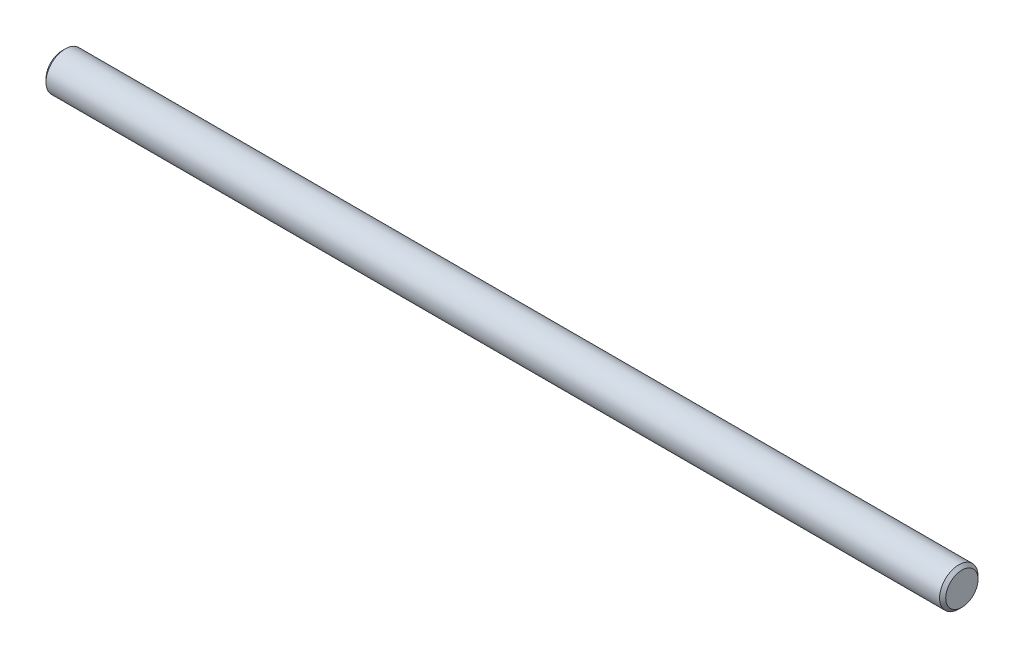
ISO-10303-21;
HEADER;
FILE_DESCRIPTION(('STEP AP214'),'2;1');
FILE_NAME('part.step','',(''),(''),'','','');
FILE_SCHEMA(('AUTOMOTIVE_DESIGN { 1 0 10303 214 1 1 1 1 }'));
ENDSEC;
DATA;
#1=APPLICATION_CONTEXT('core data for automotive mechanical design processes');
#2=APPLICATION_PROTOCOL_DEFINITION('international standard','automotive_design',2000,#1);
#3=PRODUCT_CONTEXT('',#1,'mechanical');
#4=PRODUCT('Part','Part','',(#3));
#5=PRODUCT_RELATED_PRODUCT_CATEGORY('part','',(#4));
#6=PRODUCT_DEFINITION_FORMATION('','',#4);
#7=PRODUCT_DEFINITION_CONTEXT('part definition',#1,'design');
#8=PRODUCT_DEFINITION('design','',#6,#7);
#9=PRODUCT_DEFINITION_SHAPE('','',#8);
#10=(LENGTH_UNIT() NAMED_UNIT(*) SI_UNIT(.MILLI.,.METRE.));
#11=(NAMED_UNIT(*) PLANE_ANGLE_UNIT() SI_UNIT($,.RADIAN.));
#12=(NAMED_UNIT(*) SI_UNIT($,.STERADIAN.) SOLID_ANGLE_UNIT());
#13=UNCERTAINTY_MEASURE_WITH_UNIT(LENGTH_MEASURE(1.E-05),#10,'distance_accuracy_value','');
#14=(GEOMETRIC_REPRESENTATION_CONTEXT(3) GLOBAL_UNCERTAINTY_ASSIGNED_CONTEXT((#13)) GLOBAL_UNIT_ASSIGNED_CONTEXT((#10,
#11,#12)) REPRESENTATION_CONTEXT('',''));
#15=CARTESIAN_POINT('',(0.,0.,0.));
#16=DIRECTION('',(0.,0.,1.));
#17=DIRECTION('',(1.,0.,0.));
#18=AXIS2_PLACEMENT_3D('',#15,#16,#17);
#19=CARTESIAN_POINT('',(0.,0.,0.));
#20=DIRECTION('',(1.,0.,0.));
#21=DIRECTION('',(0.,0.,-1.));
#22=AXIS2_PLACEMENT_3D('',#19,#20,#21);
#23=PLANE('',#22);
#24=CARTESIAN_POINT('',(0.,0.,0.));
#25=DIRECTION('',(1.,0.,0.));
#26=DIRECTION('',(0.,0.,-1.));
#27=AXIS2_PLACEMENT_3D('',#24,#25,#26);
#28=CIRCLE('',#27,2.10000000000002);
#29=CARTESIAN_POINT('',(0.,0.,-2.10000000000002));
#30=VERTEX_POINT('',#29);
#31=EDGE_CURVE('E10',#30,#30,#28,.F.);
#32=ORIENTED_EDGE('',*,*,#31,.T.);
#33=EDGE_LOOP('',(#32));
#34=FACE_BOUND('',#33,.T.);
#35=ADVANCED_FACE('F38',(#34),#23,.F.);
#36=CARTESIAN_POINT('',(0.,0.,0.));
#37=DIRECTION('',(-1.,0.,0.));
#38=DIRECTION('',(0.,0.,1.));
#39=AXIS2_PLACEMENT_3D('',#36,#37,#38);
#40=CYLINDRICAL_SURFACE('',#39,2.5);
#41=CARTESIAN_POINT('',(116.6,0.,0.));
#42=DIRECTION('',(-1.,0.,0.));
#43=DIRECTION('',(0.,0.,1.));
#44=AXIS2_PLACEMENT_3D('',#41,#42,#43);
#45=CIRCLE('',#44,2.5);
#46=CARTESIAN_POINT('',(116.6,0.,2.5));
#47=VERTEX_POINT('',#46);
#48=EDGE_CURVE('E51',#47,#47,#45,.T.);
#49=ORIENTED_EDGE('',*,*,#48,.T.);
#50=EDGE_LOOP('',(#49));
#51=FACE_BOUND('',#50,.T.);
#52=CARTESIAN_POINT('',(0.399999999999989,0.,0.));
#53=DIRECTION('',(1.,0.,0.));
#54=DIRECTION('',(0.,0.,-1.));
#55=AXIS2_PLACEMENT_3D('',#52,#53,#54);
#56=CIRCLE('',#55,2.5);
#57=CARTESIAN_POINT('',(0.399999999999989,0.,-2.5));
#58=VERTEX_POINT('',#57);
#59=EDGE_CURVE('E55',#58,#58,#56,.T.);
#60=ORIENTED_EDGE('',*,*,#59,.T.);
#61=EDGE_LOOP('',(#60));
#62=FACE_BOUND('',#61,.T.);
#63=ADVANCED_FACE('F61',(#51,#62),#40,.T.);
#64=CARTESIAN_POINT('',(117.,0.,0.));
#65=DIRECTION('',(-1.,0.,0.));
#66=DIRECTION('',(0.,0.,1.));
#67=AXIS2_PLACEMENT_3D('',#64,#65,#66);
#68=PLANE('',#67);
#69=CARTESIAN_POINT('',(117.,0.,0.));
#70=DIRECTION('',(-1.,0.,0.));
#71=DIRECTION('',(0.,0.,1.));
#72=AXIS2_PLACEMENT_3D('',#69,#70,#71);
#73=CIRCLE('',#72,2.10000000000002);
#74=CARTESIAN_POINT('',(117.,0.,2.10000000000002));
#75=VERTEX_POINT('',#74);
#76=EDGE_CURVE('E46',#75,#75,#73,.F.);
#77=ORIENTED_EDGE('',*,*,#76,.T.);
#78=EDGE_LOOP('',(#77));
#79=FACE_BOUND('',#78,.T.);
#80=ADVANCED_FACE('F69',(#79),#68,.F.);
#81=CARTESIAN_POINT('',(116.6,0.,0.));
#82=DIRECTION('',(-1.,0.,0.));
#83=DIRECTION('',(0.,0.,1.));
#84=AXIS2_PLACEMENT_3D('',#81,#82,#83);
#85=CONICAL_SURFACE('',#84,2.5,0.785398163397446);
#86=ORIENTED_EDGE('',*,*,#76,.F.);
#87=EDGE_LOOP('',(#86));
#88=FACE_BOUND('',#87,.T.);
#89=ORIENTED_EDGE('',*,*,#48,.F.);
#90=EDGE_LOOP('',(#89));
#91=FACE_BOUND('',#90,.T.);
#92=ADVANCED_FACE('F65',(#88,#91),#85,.T.);
#93=CARTESIAN_POINT('',(0.,0.,0.));
#94=DIRECTION('',(1.,0.,0.));
#95=DIRECTION('',(0.,0.,-1.));
#96=AXIS2_PLACEMENT_3D('',#93,#94,#95);
#97=CONICAL_SURFACE('',#96,2.10000000000002,0.785398163397439);
#98=ORIENTED_EDGE('',*,*,#59,.F.);
#99=EDGE_LOOP('',(#98));
#100=FACE_BOUND('',#99,.T.);
#101=ORIENTED_EDGE('',*,*,#31,.F.);
#102=EDGE_LOOP('',(#101));
#103=FACE_BOUND('',#102,.T.);
#104=ADVANCED_FACE('F40',(#100,#103),#97,.T.);
#105=CLOSED_SHELL('',(#35,#63,#80,#92,#104));
#106=MANIFOLD_SOLID_BREP('B2',#105);
#107=ADVANCED_BREP_SHAPE_REPRESENTATION('',(#18,#106),#14);
#108=SHAPE_DEFINITION_REPRESENTATION(#9,#107);
ENDSEC;
END-ISO-10303-21;
